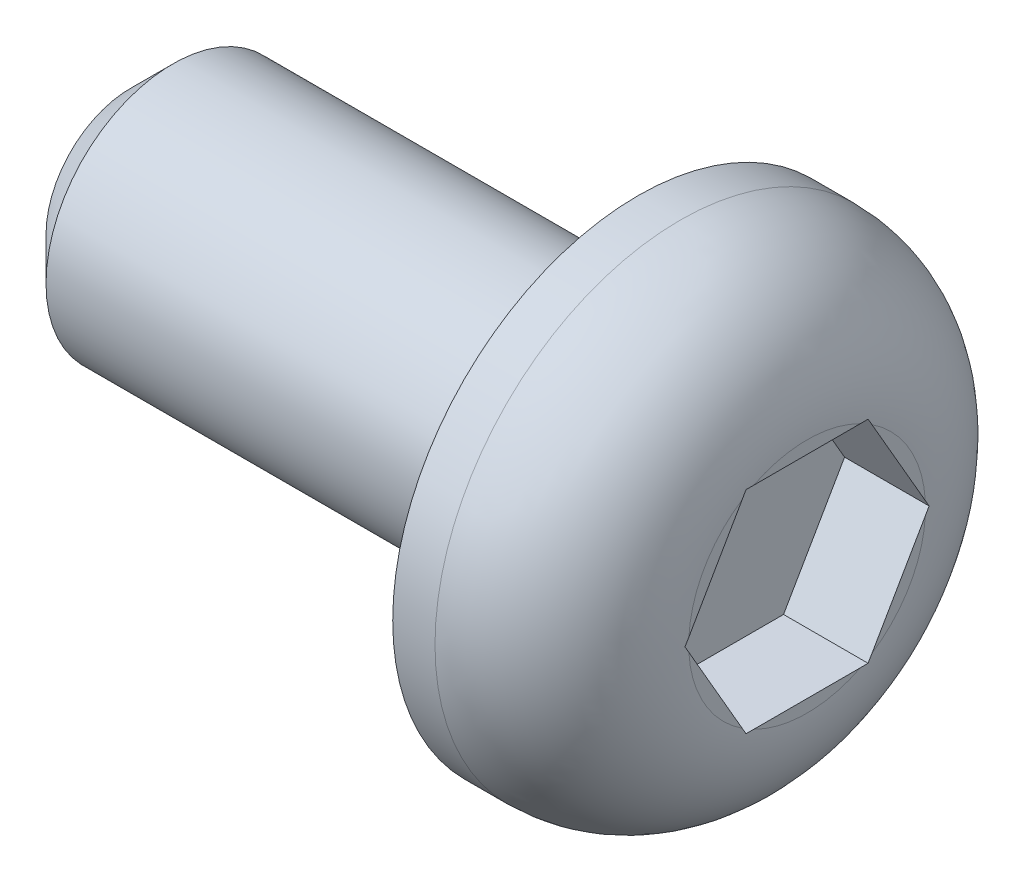
ISO-10303-21;
HEADER;
FILE_DESCRIPTION(('STEP AP214'),'2;1');
FILE_NAME('part.step','',(''),(''),'','','');
FILE_SCHEMA(('AUTOMOTIVE_DESIGN { 1 0 10303 214 1 1 1 1 }'));
ENDSEC;
DATA;
#1=APPLICATION_CONTEXT('core data for automotive mechanical design processes');
#2=APPLICATION_PROTOCOL_DEFINITION('international standard','automotive_design',2000,#1);
#3=PRODUCT_CONTEXT('',#1,'mechanical');
#4=PRODUCT('Part','Part','',(#3));
#5=PRODUCT_RELATED_PRODUCT_CATEGORY('part','',(#4));
#6=PRODUCT_DEFINITION_FORMATION('','',#4);
#7=PRODUCT_DEFINITION_CONTEXT('part definition',#1,'design');
#8=PRODUCT_DEFINITION('design','',#6,#7);
#9=PRODUCT_DEFINITION_SHAPE('','',#8);
#10=(LENGTH_UNIT() NAMED_UNIT(*) SI_UNIT(.MILLI.,.METRE.));
#11=(NAMED_UNIT(*) PLANE_ANGLE_UNIT() SI_UNIT($,.RADIAN.));
#12=(NAMED_UNIT(*) SI_UNIT($,.STERADIAN.) SOLID_ANGLE_UNIT());
#13=UNCERTAINTY_MEASURE_WITH_UNIT(LENGTH_MEASURE(1.E-05),#10,'distance_accuracy_value','');
#14=(GEOMETRIC_REPRESENTATION_CONTEXT(3) GLOBAL_UNCERTAINTY_ASSIGNED_CONTEXT((#13)) GLOBAL_UNIT_ASSIGNED_CONTEXT((#10,
#11,#12)) REPRESENTATION_CONTEXT('',''));
#15=CARTESIAN_POINT('',(0.,0.,0.));
#16=DIRECTION('',(0.,0.,1.));
#17=DIRECTION('',(1.,0.,0.));
#18=AXIS2_PLACEMENT_3D('',#15,#16,#17);
#19=CARTESIAN_POINT('',(2.,0.,0.));
#20=DIRECTION('',(1.,0.,0.));
#21=DIRECTION('',(0.,0.,-1.));
#22=AXIS2_PLACEMENT_3D('',#19,#20,#21);
#23=PLANE('',#22);
#24=DIRECTION('',(0.,-0.866025403784439,-0.5));
#25=VECTOR('',#24,1.);
#26=CARTESIAN_POINT('',(2.,0.,2.94337567297406));
#27=LINE('',#26,#25);
#28=CARTESIAN_POINT('',(2.,-0.0789917583039617,2.89776976005351));
#29=VERTEX_POINT('',#28);
#30=CARTESIAN_POINT('',(2.,-1.17100824169604,2.26729374940759));
#31=VERTEX_POINT('',#30);
#32=EDGE_CURVE('E164',#29,#31,#27,.T.);
#33=ORIENTED_EDGE('',*,*,#32,.F.);
#34=CARTESIAN_POINT('',(2.,0.,1.5));
#35=DIRECTION('',(1.,0.,0.));
#36=DIRECTION('',(0.,0.,-1.));
#37=AXIS2_PLACEMENT_3D('',#34,#35,#36);
#38=CIRCLE('',#37,1.4);
#39=EDGE_CURVE('E201',#29,#31,#38,.T.);
#40=ORIENTED_EDGE('',*,*,#39,.T.);
#41=EDGE_LOOP('',(#33,#40));
#42=FACE_BOUND('',#41,.T.);
#43=ADVANCED_FACE('F34',(#42),#23,.T.);
#44=DIRECTION('',(0.,0.,-1.));
#45=VECTOR('',#44,1.);
#46=CARTESIAN_POINT('',(2.,-1.25,2.22168783648703));
#47=LINE('',#46,#45);
#48=CARTESIAN_POINT('',(2.,-1.25,2.13047601064592));
#49=VERTEX_POINT('',#48);
#50=CARTESIAN_POINT('',(2.,-1.25,0.869523989354076));
#51=VERTEX_POINT('',#50);
#52=EDGE_CURVE('E166',#49,#51,#47,.T.);
#53=ORIENTED_EDGE('',*,*,#52,.F.);
#54=CARTESIAN_POINT('',(2.,0.,1.5));
#55=DIRECTION('',(1.,0.,0.));
#56=DIRECTION('',(0.,0.,-1.));
#57=AXIS2_PLACEMENT_3D('',#54,#55,#56);
#58=CIRCLE('',#57,1.4);
#59=EDGE_CURVE('E199',#49,#51,#58,.T.);
#60=ORIENTED_EDGE('',*,*,#59,.T.);
#61=EDGE_LOOP('',(#53,#60));
#62=FACE_BOUND('',#61,.T.);
#63=ADVANCED_FACE('F254',(#62),#23,.T.);
#64=DIRECTION('',(0.,0.866025403784439,-0.5));
#65=VECTOR('',#64,1.);
#66=CARTESIAN_POINT('',(2.,-1.25,0.778312163512968));
#67=LINE('',#66,#65);
#68=CARTESIAN_POINT('',(2.,-1.17100824169604,0.732706250592413));
#69=VERTEX_POINT('',#68);
#70=CARTESIAN_POINT('',(2.,-0.0789917583039618,0.102230239946489));
#71=VERTEX_POINT('',#70);
#72=EDGE_CURVE('E169',#69,#71,#67,.T.);
#73=ORIENTED_EDGE('',*,*,#72,.F.);
#74=CARTESIAN_POINT('',(2.,0.,1.5));
#75=DIRECTION('',(1.,0.,0.));
#76=DIRECTION('',(0.,0.,-1.));
#77=AXIS2_PLACEMENT_3D('',#74,#75,#76);
#78=CIRCLE('',#77,1.4);
#79=EDGE_CURVE('E197',#69,#71,#78,.T.);
#80=ORIENTED_EDGE('',*,*,#79,.T.);
#81=EDGE_LOOP('',(#73,#80));
#82=FACE_BOUND('',#81,.T.);
#83=ADVANCED_FACE('F259',(#82),#23,.T.);
#84=DIRECTION('',(0.,0.866025403784439,0.5));
#85=VECTOR('',#84,1.);
#86=CARTESIAN_POINT('',(2.,0.,0.0566243270259353));
#87=LINE('',#86,#85);
#88=CARTESIAN_POINT('',(2.,0.0789917583039615,0.10223023994649));
#89=VERTEX_POINT('',#88);
#90=CARTESIAN_POINT('',(2.,1.17100824169604,0.732706250592413));
#91=VERTEX_POINT('',#90);
#92=EDGE_CURVE('E172',#89,#91,#87,.T.);
#93=ORIENTED_EDGE('',*,*,#92,.F.);
#94=CARTESIAN_POINT('',(2.,0.,1.5));
#95=DIRECTION('',(1.,0.,0.));
#96=DIRECTION('',(0.,0.,-1.));
#97=AXIS2_PLACEMENT_3D('',#94,#95,#96);
#98=CIRCLE('',#97,1.4);
#99=EDGE_CURVE('E195',#89,#91,#98,.T.);
#100=ORIENTED_EDGE('',*,*,#99,.T.);
#101=EDGE_LOOP('',(#93,#100));
#102=FACE_BOUND('',#101,.T.);
#103=ADVANCED_FACE('F249',(#102),#23,.T.);
#104=DIRECTION('',(0.,0.,1.));
#105=VECTOR('',#104,1.);
#106=CARTESIAN_POINT('',(2.,1.25,0.778312163512968));
#107=LINE('',#106,#105);
#108=CARTESIAN_POINT('',(2.,1.25,0.869523989354076));
#109=VERTEX_POINT('',#108);
#110=CARTESIAN_POINT('',(2.,1.25,2.13047601064592));
#111=VERTEX_POINT('',#110);
#112=EDGE_CURVE('E154',#109,#111,#107,.T.);
#113=ORIENTED_EDGE('',*,*,#112,.F.);
#114=CARTESIAN_POINT('',(2.,0.,1.5));
#115=DIRECTION('',(1.,0.,0.));
#116=DIRECTION('',(0.,0.,-1.));
#117=AXIS2_PLACEMENT_3D('',#114,#115,#116);
#118=CIRCLE('',#117,1.4);
#119=EDGE_CURVE('E193',#109,#111,#118,.T.);
#120=ORIENTED_EDGE('',*,*,#119,.T.);
#121=EDGE_LOOP('',(#113,#120));
#122=FACE_BOUND('',#121,.T.);
#123=ADVANCED_FACE('F240',(#122),#23,.T.);
#124=CARTESIAN_POINT('',(0.,0.,1.5));
#125=DIRECTION('',(1.,0.,0.));
#126=DIRECTION('',(0.,0.,-1.));
#127=AXIS2_PLACEMENT_3D('',#124,#125,#126);
#128=CYLINDRICAL_SURFACE('',#127,1.5);
#129=CARTESIAN_POINT('',(-5.5,0.,1.5));
#130=DIRECTION('',(-1.,0.,0.));
#131=DIRECTION('',(0.,0.,1.));
#132=AXIS2_PLACEMENT_3D('',#129,#130,#131);
#133=CIRCLE('',#132,1.5);
#134=CARTESIAN_POINT('',(-5.5,0.,3.));
#135=VERTEX_POINT('',#134);
#136=EDGE_CURVE('E42',#135,#135,#133,.F.);
#137=ORIENTED_EDGE('',*,*,#136,.T.);
#138=EDGE_LOOP('',(#137));
#139=FACE_BOUND('',#138,.T.);
#140=CARTESIAN_POINT('',(0.,0.,1.5));
#141=DIRECTION('',(1.,0.,0.));
#142=DIRECTION('',(0.,0.,-1.));
#143=AXIS2_PLACEMENT_3D('',#140,#141,#142);
#144=CIRCLE('',#143,1.5);
#145=CARTESIAN_POINT('',(0.,0.,0.));
#146=VERTEX_POINT('',#145);
#147=EDGE_CURVE('E177',#146,#146,#144,.T.);
#148=ORIENTED_EDGE('',*,*,#147,.F.);
#149=EDGE_LOOP('',(#148));
#150=FACE_BOUND('',#149,.T.);
#151=ADVANCED_FACE('F242',(#139,#150),#128,.T.);
#152=CARTESIAN_POINT('',(-6.,0.,0.));
#153=DIRECTION('',(-1.,0.,0.));
#154=DIRECTION('',(0.,0.,1.));
#155=AXIS2_PLACEMENT_3D('',#152,#153,#154);
#156=PLANE('',#155);
#157=CARTESIAN_POINT('',(-6.,0.,1.5));
#158=DIRECTION('',(-1.,0.,0.));
#159=DIRECTION('',(0.,0.,1.));
#160=AXIS2_PLACEMENT_3D('',#157,#158,#159);
#161=CIRCLE('',#160,0.999999999999996);
#162=CARTESIAN_POINT('',(-6.,0.,2.5));
#163=VERTEX_POINT('',#162);
#164=EDGE_CURVE('E11',#163,#163,#161,.T.);
#165=ORIENTED_EDGE('',*,*,#164,.T.);
#166=EDGE_LOOP('',(#165));
#167=FACE_BOUND('',#166,.T.);
#168=ADVANCED_FACE('F238',(#167),#156,.T.);
#169=DIRECTION('',(0.,-0.866025403784439,0.5));
#170=VECTOR('',#169,1.);
#171=CARTESIAN_POINT('',(2.,1.25,2.22168783648703));
#172=LINE('',#171,#170);
#173=CARTESIAN_POINT('',(2.,1.17100824169604,2.26729374940759));
#174=VERTEX_POINT('',#173);
#175=CARTESIAN_POINT('',(2.,0.0789917583039618,2.89776976005351));
#176=VERTEX_POINT('',#175);
#177=EDGE_CURVE('E151',#174,#176,#172,.T.);
#178=ORIENTED_EDGE('',*,*,#177,.F.);
#179=CARTESIAN_POINT('',(2.,0.,1.5));
#180=DIRECTION('',(1.,0.,0.));
#181=DIRECTION('',(0.,0.,-1.));
#182=AXIS2_PLACEMENT_3D('',#179,#180,#181);
#183=CIRCLE('',#182,1.4);
#184=EDGE_CURVE('E191',#174,#176,#183,.T.);
#185=ORIENTED_EDGE('',*,*,#184,.T.);
#186=EDGE_LOOP('',(#178,#185));
#187=FACE_BOUND('',#186,.T.);
#188=ADVANCED_FACE('F234',(#187),#23,.T.);
#189=CARTESIAN_POINT('',(0.,0.,1.5));
#190=DIRECTION('',(1.,0.,0.));
#191=DIRECTION('',(0.,0.,-1.));
#192=AXIS2_PLACEMENT_3D('',#189,#190,#191);
#193=CYLINDRICAL_SURFACE('',#192,2.9);
#194=CARTESIAN_POINT('',(0.5,0.,1.5));
#195=DIRECTION('',(1.,0.,0.));
#196=DIRECTION('',(0.,0.,-1.));
#197=AXIS2_PLACEMENT_3D('',#194,#195,#196);
#198=CIRCLE('',#197,2.9);
#199=CARTESIAN_POINT('',(0.5,0.,-1.4));
#200=VERTEX_POINT('',#199);
#201=EDGE_CURVE('E481',#200,#200,#198,.F.);
#202=ORIENTED_EDGE('',*,*,#201,.T.);
#203=EDGE_LOOP('',(#202));
#204=FACE_BOUND('',#203,.T.);
#205=CARTESIAN_POINT('',(0.,0.,1.5));
#206=DIRECTION('',(1.,0.,0.));
#207=DIRECTION('',(0.,0.,-1.));
#208=AXIS2_PLACEMENT_3D('',#205,#206,#207);
#209=CIRCLE('',#208,2.9);
#210=CARTESIAN_POINT('',(0.,0.,-1.4));
#211=VERTEX_POINT('',#210);
#212=EDGE_CURVE('E188',#211,#211,#209,.T.);
#213=ORIENTED_EDGE('',*,*,#212,.T.);
#214=EDGE_LOOP('',(#213));
#215=FACE_BOUND('',#214,.T.);
#216=ADVANCED_FACE('F230',(#204,#215),#193,.T.);
#217=CARTESIAN_POINT('',(0.,0.,0.));
#218=DIRECTION('',(1.,0.,0.));
#219=DIRECTION('',(0.,0.,-1.));
#220=AXIS2_PLACEMENT_3D('',#217,#218,#219);
#221=PLANE('',#220);
#222=ORIENTED_EDGE('',*,*,#212,.F.);
#223=EDGE_LOOP('',(#222));
#224=FACE_BOUND('',#223,.T.);
#225=ORIENTED_EDGE('',*,*,#147,.T.);
#226=EDGE_LOOP('',(#225));
#227=FACE_BOUND('',#226,.T.);
#228=ADVANCED_FACE('F224',(#224,#227),#221,.F.);
#229=CARTESIAN_POINT('',(1.,0.,2.94337567297406));
#230=DIRECTION('',(0.,-0.5,0.866025403784439));
#231=DIRECTION('',(0.,-0.866025403784439,-0.5));
#232=AXIS2_PLACEMENT_3D('',#229,#230,#231);
#233=PLANE('',#232);
#234=ORIENTED_EDGE('',*,*,#32,.T.);
#235=CARTESIAN_POINT('',(2.,-1.17100824169604,2.26729374940759));
#236=CARTESIAN_POINT('',(2.00000539805275,-1.1841741811381,2.25969239072658));
#237=CARTESIAN_POINT('',(1.99995582374529,-1.19733979317484,2.25209122107312));
#238=CARTESIAN_POINT('',(1.99974673027623,-1.223670379277,2.23688925009912));
#239=CARTESIAN_POINT('',(1.999587210974,-1.23683535334158,2.22928844877906));
#240=CARTESIAN_POINT('',(1.99937271917094,-1.25,2.22168783648703));
#241=B_SPLINE_CURVE_WITH_KNOTS('',3,(#235,#236,#237,#238,#239,#240),.UNSPECIFIED.,.F.,.F.,(4,2,
4),(0.,0.0456072604102869,0.091214579155445),.UNSPECIFIED.);
#242=CARTESIAN_POINT('',(1.99937271917094,-1.25,2.22168783648703));
#243=VERTEX_POINT('',#242);
#244=EDGE_CURVE('E133',#31,#243,#241,.T.);
#245=ORIENTED_EDGE('',*,*,#244,.T.);
#246=DIRECTION('',(1.,0.,0.));
#247=VECTOR('',#246,1.);
#248=CARTESIAN_POINT('',(1.,-1.25,2.22168783648703));
#249=LINE('',#248,#247);
#250=CARTESIAN_POINT('',(1.,-1.25,2.22168783648703));
#251=VERTEX_POINT('',#250);
#252=EDGE_CURVE('E125',#251,#243,#249,.T.);
#253=ORIENTED_EDGE('',*,*,#252,.F.);
#254=DIRECTION('',(0.,-0.866025403784439,-0.5));
#255=VECTOR('',#254,1.);
#256=CARTESIAN_POINT('',(1.,0.,2.94337567297406));
#257=LINE('',#256,#255);
#258=CARTESIAN_POINT('',(1.,0.,2.94337567297406));
#259=VERTEX_POINT('',#258);
#260=EDGE_CURVE('E131',#259,#251,#257,.T.);
#261=ORIENTED_EDGE('',*,*,#260,.F.);
#262=DIRECTION('',(1.,0.,0.));
#263=VECTOR('',#262,1.);
#264=CARTESIAN_POINT('',(1.,0.,2.94337567297406));
#265=LINE('',#264,#263);
#266=CARTESIAN_POINT('',(1.99937271917094,0.,2.94337567297406));
#267=VERTEX_POINT('',#266);
#268=EDGE_CURVE('E175',#259,#267,#265,.T.);
#269=ORIENTED_EDGE('',*,*,#268,.T.);
#270=CARTESIAN_POINT('',(1.99937271917094,0.,2.94337567297406));
#271=CARTESIAN_POINT('',(1.999587210974,-0.0131646466584189,2.93577506068204));
#272=CARTESIAN_POINT('',(1.99974673027623,-0.0263296207229975,2.92817425936198));
#273=CARTESIAN_POINT('',(1.99995582374529,-0.0526602068251556,2.91297228838798));
#274=CARTESIAN_POINT('',(2.00000539805275,-0.0658258188618976,2.90537111873452));
#275=CARTESIAN_POINT('',(2.,-0.0789917583039617,2.89776976005351));
#276=B_SPLINE_CURVE_WITH_KNOTS('',3,(#270,#271,#272,#273,#274,#275),.UNSPECIFIED.,.F.,.F.,(4,2,
4),(0.,0.0456073187451573,0.0912145791554439),.UNSPECIFIED.);
#277=EDGE_CURVE('E204',#267,#29,#276,.T.);
#278=ORIENTED_EDGE('',*,*,#277,.T.);
#279=EDGE_LOOP('',(#234,#245,#253,#261,#269,#278));
#280=FACE_BOUND('',#279,.T.);
#281=ADVANCED_FACE('F128',(#280),#233,.F.);
#282=CARTESIAN_POINT('',(1.,1.25,2.22168783648703));
#283=DIRECTION('',(0.,0.5,0.866025403784439));
#284=DIRECTION('',(0.,-0.866025403784439,0.5));
#285=AXIS2_PLACEMENT_3D('',#282,#283,#284);
#286=PLANE('',#285);
#287=DIRECTION('',(1.,0.,0.));
#288=VECTOR('',#287,1.);
#289=CARTESIAN_POINT('',(1.,1.25,2.22168783648703));
#290=LINE('',#289,#288);
#291=CARTESIAN_POINT('',(1.,1.25,2.22168783648703));
#292=VERTEX_POINT('',#291);
#293=CARTESIAN_POINT('',(1.99937271917094,1.25,2.22168783648703));
#294=VERTEX_POINT('',#293);
#295=EDGE_CURVE('E178',#292,#294,#290,.T.);
#296=ORIENTED_EDGE('',*,*,#295,.T.);
#297=CARTESIAN_POINT('',(1.99937271917094,1.25,2.22168783648703));
#298=CARTESIAN_POINT('',(1.999587210974,1.23683535334158,2.22928844877906));
#299=CARTESIAN_POINT('',(1.99974673027623,1.223670379277,2.23688925009912));
#300=CARTESIAN_POINT('',(1.99995582374529,1.19733979317484,2.25209122107312));
#301=CARTESIAN_POINT('',(2.00000539805275,1.1841741811381,2.25969239072658));
#302=CARTESIAN_POINT('',(2.,1.17100824169604,2.26729374940759));
#303=B_SPLINE_CURVE_WITH_KNOTS('',3,(#297,#298,#299,#300,#301,#302),.UNSPECIFIED.,.F.,.F.,(4,2,
4),(0.,0.0456073187451579,0.0912145791554451),.UNSPECIFIED.);
#304=EDGE_CURVE('E334',#294,#174,#303,.T.);
#305=ORIENTED_EDGE('',*,*,#304,.T.);
#306=ORIENTED_EDGE('',*,*,#177,.T.);
#307=CARTESIAN_POINT('',(2.,0.0789917583039618,2.89776976005351));
#308=CARTESIAN_POINT('',(2.00000539805275,0.0658258188618976,2.90537111873452));
#309=CARTESIAN_POINT('',(1.99995582374529,0.0526602068251556,2.91297228838798));
#310=CARTESIAN_POINT('',(1.99974673027623,0.0263296207229974,2.92817425936198));
#311=CARTESIAN_POINT('',(1.999587210974,0.0131646466584188,2.93577506068204));
#312=CARTESIAN_POINT('',(1.99937271917094,0.,2.94337567297406));
#313=B_SPLINE_CURVE_WITH_KNOTS('',3,(#307,#308,#309,#310,#311,#312),.UNSPECIFIED.,.F.,.F.,(4,2,
4),(0.,0.0456072604102868,0.0912145791554441),.UNSPECIFIED.);
#314=EDGE_CURVE('E328',#176,#267,#313,.T.);
#315=ORIENTED_EDGE('',*,*,#314,.T.);
#316=ORIENTED_EDGE('',*,*,#268,.F.);
#317=DIRECTION('',(0.,-0.866025403784439,0.5));
#318=VECTOR('',#317,1.);
#319=CARTESIAN_POINT('',(1.,1.25,2.22168783648703));
#320=LINE('',#319,#318);
#321=EDGE_CURVE('E137',#292,#259,#320,.T.);
#322=ORIENTED_EDGE('',*,*,#321,.F.);
#323=EDGE_LOOP('',(#296,#305,#306,#315,#316,#322));
#324=FACE_BOUND('',#323,.T.);
#325=ADVANCED_FACE('F223',(#324),#286,.F.);
#326=CARTESIAN_POINT('',(1.,1.25,0.778312163512968));
#327=DIRECTION('',(0.,1.,0.));
#328=DIRECTION('',(0.,0.,1.));
#329=AXIS2_PLACEMENT_3D('',#326,#327,#328);
#330=PLANE('',#329);
#331=DIRECTION('',(1.,0.,0.));
#332=VECTOR('',#331,1.);
#333=CARTESIAN_POINT('',(1.,1.25,0.778312163512968));
#334=LINE('',#333,#332);
#335=CARTESIAN_POINT('',(1.,1.25,0.778312163512968));
#336=VERTEX_POINT('',#335);
#337=CARTESIAN_POINT('',(1.99937271917094,1.25,0.778312163512968));
#338=VERTEX_POINT('',#337);
#339=EDGE_CURVE('E180',#336,#338,#334,.T.);
#340=ORIENTED_EDGE('',*,*,#339,.T.);
#341=CARTESIAN_POINT('',(1.99937271917094,1.25,0.778312163512968));
#342=CARTESIAN_POINT('',(1.999587210974,1.25,0.793513388097017));
#343=CARTESIAN_POINT('',(1.99974673027623,1.25,0.808714990737135));
#344=CARTESIAN_POINT('',(1.99995582374529,1.25,0.839118932685138));
#345=CARTESIAN_POINT('',(2.00000539805275,1.25,0.854321271992056));
#346=CARTESIAN_POINT('',(2.,1.25,0.869523989354076));
#347=B_SPLINE_CURVE_WITH_KNOTS('',3,(#341,#342,#343,#344,#345,#346),.UNSPECIFIED.,.F.,.F.,(4,2,
4),(0.,0.0456073187451576,0.0912145791554443),.UNSPECIFIED.);
#348=EDGE_CURVE('E322',#338,#109,#347,.T.);
#349=ORIENTED_EDGE('',*,*,#348,.T.);
#350=ORIENTED_EDGE('',*,*,#112,.T.);
#351=CARTESIAN_POINT('',(2.,1.25,2.13047601064592));
#352=CARTESIAN_POINT('',(2.00000539805275,1.25,2.14567872800794));
#353=CARTESIAN_POINT('',(1.99995582374529,1.25,2.16088106731486));
#354=CARTESIAN_POINT('',(1.99974673027623,1.25,2.19128500926286));
#355=CARTESIAN_POINT('',(1.999587210974,1.25,2.20648661190298));
#356=CARTESIAN_POINT('',(1.99937271917094,1.25,2.22168783648703));
#357=B_SPLINE_CURVE_WITH_KNOTS('',3,(#351,#352,#353,#354,#355,#356),.UNSPECIFIED.,.F.,.F.,(4,2,
4),(0.,0.0456072604102869,0.0912145791554451),.UNSPECIFIED.);
#358=EDGE_CURVE('E49',#111,#294,#357,.T.);
#359=ORIENTED_EDGE('',*,*,#358,.T.);
#360=ORIENTED_EDGE('',*,*,#295,.F.);
#361=DIRECTION('',(0.,0.,1.));
#362=VECTOR('',#361,1.);
#363=CARTESIAN_POINT('',(1.,1.25,0.778312163512968));
#364=LINE('',#363,#362);
#365=EDGE_CURVE('E161',#336,#292,#364,.T.);
#366=ORIENTED_EDGE('',*,*,#365,.F.);
#367=EDGE_LOOP('',(#340,#349,#350,#359,#360,#366));
#368=FACE_BOUND('',#367,.T.);
#369=ADVANCED_FACE('F302',(#368),#330,.F.);
#370=CARTESIAN_POINT('',(1.,0.,0.0566243270259355));
#371=DIRECTION('',(0.,0.5,-0.866025403784439));
#372=DIRECTION('',(0.,0.866025403784439,0.5));
#373=AXIS2_PLACEMENT_3D('',#370,#371,#372);
#374=PLANE('',#373);
#375=DIRECTION('',(1.,0.,0.));
#376=VECTOR('',#375,1.);
#377=CARTESIAN_POINT('',(1.,0.,0.0566243270259355));
#378=LINE('',#377,#376);
#379=CARTESIAN_POINT('',(1.,0.,0.0566243270259355));
#380=VERTEX_POINT('',#379);
#381=CARTESIAN_POINT('',(1.99937271917094,0.,0.0566243270259353));
#382=VERTEX_POINT('',#381);
#383=EDGE_CURVE('E182',#380,#382,#378,.T.);
#384=ORIENTED_EDGE('',*,*,#383,.T.);
#385=CARTESIAN_POINT('',(1.99937271917094,0.,0.0566243270259353));
#386=CARTESIAN_POINT('',(1.999587210974,0.013164646658419,0.0642249393179598));
#387=CARTESIAN_POINT('',(1.99974673027623,0.0263296207229976,0.0718257406380187));
#388=CARTESIAN_POINT('',(1.99995582374529,0.0526602068251556,0.0870277116120203));
#389=CARTESIAN_POINT('',(2.00000539805275,0.0658258188618976,0.0946288812654794));
#390=CARTESIAN_POINT('',(2.,0.0789917583039616,0.102230239946489));
#391=B_SPLINE_CURVE_WITH_KNOTS('',3,(#385,#386,#387,#388,#389,#390),.UNSPECIFIED.,.F.,.F.,(4,2,
4),(0.,0.0456073187451573,0.0912145791554439),.UNSPECIFIED.);
#392=EDGE_CURVE('E311',#382,#89,#391,.T.);
#393=ORIENTED_EDGE('',*,*,#392,.T.);
#394=ORIENTED_EDGE('',*,*,#92,.T.);
#395=CARTESIAN_POINT('',(2.,1.17100824169604,0.732706250592413));
#396=CARTESIAN_POINT('',(2.00000539805275,1.1841741811381,0.740307609273423));
#397=CARTESIAN_POINT('',(1.99995582374529,1.19733979317484,0.747908778926882));
#398=CARTESIAN_POINT('',(1.99974673027623,1.223670379277,0.763110749900884));
#399=CARTESIAN_POINT('',(1.999587210974,1.23683535334158,0.770711551220943));
#400=CARTESIAN_POINT('',(1.99937271917094,1.25,0.778312163512968));
#401=B_SPLINE_CURVE_WITH_KNOTS('',3,(#395,#396,#397,#398,#399,#400),.UNSPECIFIED.,.F.,.F.,(4,2,
4),(0.,0.0456072604102868,0.0912145791554442),.UNSPECIFIED.);
#402=EDGE_CURVE('E57',#91,#338,#401,.T.);
#403=ORIENTED_EDGE('',*,*,#402,.T.);
#404=ORIENTED_EDGE('',*,*,#339,.F.);
#405=DIRECTION('',(0.,0.866025403784439,0.5));
#406=VECTOR('',#405,1.);
#407=CARTESIAN_POINT('',(1.,0.,0.0566243270259355));
#408=LINE('',#407,#406);
#409=EDGE_CURVE('E158',#380,#336,#408,.T.);
#410=ORIENTED_EDGE('',*,*,#409,.F.);
#411=EDGE_LOOP('',(#384,#393,#394,#403,#404,#410));
#412=FACE_BOUND('',#411,.T.);
#413=ADVANCED_FACE('F296',(#412),#374,.F.);
#414=CARTESIAN_POINT('',(1.,-1.25,0.778312163512968));
#415=DIRECTION('',(0.,-0.5,-0.866025403784439));
#416=DIRECTION('',(0.,0.866025403784439,-0.5));
#417=AXIS2_PLACEMENT_3D('',#414,#415,#416);
#418=PLANE('',#417);
#419=DIRECTION('',(1.,0.,0.));
#420=VECTOR('',#419,1.);
#421=CARTESIAN_POINT('',(1.,-1.25,0.778312163512968));
#422=LINE('',#421,#420);
#423=CARTESIAN_POINT('',(1.,-1.25,0.778312163512968));
#424=VERTEX_POINT('',#423);
#425=CARTESIAN_POINT('',(1.99937271917094,-1.25,0.778312163512968));
#426=VERTEX_POINT('',#425);
#427=EDGE_CURVE('E136',#424,#426,#422,.T.);
#428=ORIENTED_EDGE('',*,*,#427,.T.);
#429=CARTESIAN_POINT('',(1.99937271917094,-1.25,0.778312163512968));
#430=CARTESIAN_POINT('',(1.999587210974,-1.23683535334158,0.770711551220943));
#431=CARTESIAN_POINT('',(1.99974673027623,-1.223670379277,0.763110749900884));
#432=CARTESIAN_POINT('',(1.99995582374529,-1.19733979317484,0.747908778926882));
#433=CARTESIAN_POINT('',(2.00000539805275,-1.1841741811381,0.740307609273423));
#434=CARTESIAN_POINT('',(2.,-1.17100824169604,0.732706250592413));
#435=B_SPLINE_CURVE_WITH_KNOTS('',3,(#429,#430,#431,#432,#433,#434),.UNSPECIFIED.,.F.,.F.,(4,2,
4),(0.,0.0456073187451574,0.0912145791554443),.UNSPECIFIED.);
#436=EDGE_CURVE('E286',#426,#69,#435,.T.);
#437=ORIENTED_EDGE('',*,*,#436,.T.);
#438=ORIENTED_EDGE('',*,*,#72,.T.);
#439=CARTESIAN_POINT('',(2.,-0.0789917583039615,0.10223023994649));
#440=CARTESIAN_POINT('',(2.00000539805275,-0.0658258188618976,0.0946288812654795));
#441=CARTESIAN_POINT('',(1.99995582374529,-0.0526602068251556,0.0870277116120203));
#442=CARTESIAN_POINT('',(1.99974673027623,-0.0263296207229976,0.0718257406380187));
#443=CARTESIAN_POINT('',(1.999587210974,-0.013164646658419,0.0642249393179598));
#444=CARTESIAN_POINT('',(1.99937271917094,0.,0.0566243270259353));
#445=B_SPLINE_CURVE_WITH_KNOTS('',3,(#439,#440,#441,#442,#443,#444),.UNSPECIFIED.,.F.,.F.,(4,2,
4),(0.,0.0456072604102866,0.0912145791554439),.UNSPECIFIED.);
#446=EDGE_CURVE('E270',#71,#382,#445,.T.);
#447=ORIENTED_EDGE('',*,*,#446,.T.);
#448=ORIENTED_EDGE('',*,*,#383,.F.);
#449=DIRECTION('',(0.,0.866025403784439,-0.5));
#450=VECTOR('',#449,1.);
#451=CARTESIAN_POINT('',(1.,-1.25,0.778312163512968));
#452=LINE('',#451,#450);
#453=EDGE_CURVE('E146',#424,#380,#452,.T.);
#454=ORIENTED_EDGE('',*,*,#453,.F.);
#455=EDGE_LOOP('',(#428,#437,#438,#447,#448,#454));
#456=FACE_BOUND('',#455,.T.);
#457=ADVANCED_FACE('F292',(#456),#418,.F.);
#458=CARTESIAN_POINT('',(1.,-1.25,2.22168783648703));
#459=DIRECTION('',(0.,-1.,0.));
#460=DIRECTION('',(0.,0.,-1.));
#461=AXIS2_PLACEMENT_3D('',#458,#459,#460);
#462=PLANE('',#461);
#463=ORIENTED_EDGE('',*,*,#252,.T.);
#464=CARTESIAN_POINT('',(1.99937271917094,-1.25,2.22168783648703));
#465=CARTESIAN_POINT('',(1.999587210974,-1.25,2.20648661190298));
#466=CARTESIAN_POINT('',(1.99974673027623,-1.25,2.19128500926287));
#467=CARTESIAN_POINT('',(1.99995582374529,-1.25,2.16088106731486));
#468=CARTESIAN_POINT('',(2.00000539805275,-1.25,2.14567872800794));
#469=CARTESIAN_POINT('',(2.,-1.25,2.13047601064592));
#470=B_SPLINE_CURVE_WITH_KNOTS('',3,(#464,#465,#466,#467,#468,#469),.UNSPECIFIED.,.F.,.F.,(4,2,
4),(0.,0.0456073187451577,0.0912145791554446),.UNSPECIFIED.);
#471=EDGE_CURVE('E267',#243,#49,#470,.T.);
#472=ORIENTED_EDGE('',*,*,#471,.T.);
#473=ORIENTED_EDGE('',*,*,#52,.T.);
#474=CARTESIAN_POINT('',(2.,-1.25,0.869523989354076));
#475=CARTESIAN_POINT('',(2.00000539805275,-1.25,0.854321271992056));
#476=CARTESIAN_POINT('',(1.99995582374529,-1.25,0.839118932685138));
#477=CARTESIAN_POINT('',(1.99974673027623,-1.25,0.808714990737135));
#478=CARTESIAN_POINT('',(1.999587210974,-1.25,0.793513388097017));
#479=CARTESIAN_POINT('',(1.99937271917094,-1.25,0.778312163512968));
#480=B_SPLINE_CURVE_WITH_KNOTS('',3,(#474,#475,#476,#477,#478,#479),.UNSPECIFIED.,.F.,.F.,(4,2,
4),(0.,0.0456072604102868,0.0912145791554444),.UNSPECIFIED.);
#481=EDGE_CURVE('E268',#51,#426,#480,.T.);
#482=ORIENTED_EDGE('',*,*,#481,.T.);
#483=ORIENTED_EDGE('',*,*,#427,.F.);
#484=DIRECTION('',(0.,0.,-1.));
#485=VECTOR('',#484,1.);
#486=CARTESIAN_POINT('',(1.,-1.25,2.22168783648703));
#487=LINE('',#486,#485);
#488=EDGE_CURVE('E140',#251,#424,#487,.T.);
#489=ORIENTED_EDGE('',*,*,#488,.F.);
#490=EDGE_LOOP('',(#463,#472,#473,#482,#483,#489));
#491=FACE_BOUND('',#490,.T.);
#492=ADVANCED_FACE('F141',(#491),#462,.F.);
#493=CARTESIAN_POINT('',(1.,0.,0.));
#494=DIRECTION('',(1.,0.,0.));
#495=DIRECTION('',(0.,0.,-1.));
#496=AXIS2_PLACEMENT_3D('',#493,#494,#495);
#497=PLANE('',#496);
#498=ORIENTED_EDGE('',*,*,#260,.T.);
#499=ORIENTED_EDGE('',*,*,#488,.T.);
#500=ORIENTED_EDGE('',*,*,#453,.T.);
#501=ORIENTED_EDGE('',*,*,#409,.T.);
#502=ORIENTED_EDGE('',*,*,#365,.T.);
#503=ORIENTED_EDGE('',*,*,#321,.T.);
#504=EDGE_LOOP('',(#498,#499,#500,#501,#502,#503));
#505=FACE_BOUND('',#504,.T.);
#506=ADVANCED_FACE('F148',(#505),#497,.T.);
#507=CARTESIAN_POINT('',(0.5,0.,1.5));
#508=DIRECTION('',(1.,0.,0.));
#509=DIRECTION('',(0.,0.,-1.));
#510=AXIS2_PLACEMENT_3D('',#507,#508,#509);
#511=DEGENERATE_TOROIDAL_SURFACE('',#510,1.4,1.5,.T.);
#512=ORIENTED_EDGE('',*,*,#201,.F.);
#513=EDGE_LOOP('',(#512));
#514=FACE_BOUND('',#513,.T.);
#515=ORIENTED_EDGE('',*,*,#244,.F.);
#516=ORIENTED_EDGE('',*,*,#39,.F.);
#517=ORIENTED_EDGE('',*,*,#277,.F.);
#518=ORIENTED_EDGE('',*,*,#314,.F.);
#519=ORIENTED_EDGE('',*,*,#184,.F.);
#520=ORIENTED_EDGE('',*,*,#304,.F.);
#521=ORIENTED_EDGE('',*,*,#358,.F.);
#522=ORIENTED_EDGE('',*,*,#119,.F.);
#523=ORIENTED_EDGE('',*,*,#348,.F.);
#524=ORIENTED_EDGE('',*,*,#402,.F.);
#525=ORIENTED_EDGE('',*,*,#99,.F.);
#526=ORIENTED_EDGE('',*,*,#392,.F.);
#527=ORIENTED_EDGE('',*,*,#446,.F.);
#528=ORIENTED_EDGE('',*,*,#79,.F.);
#529=ORIENTED_EDGE('',*,*,#436,.F.);
#530=ORIENTED_EDGE('',*,*,#481,.F.);
#531=ORIENTED_EDGE('',*,*,#59,.F.);
#532=ORIENTED_EDGE('',*,*,#471,.F.);
#533=EDGE_LOOP('',(#515,#516,#517,#518,#519,#520,#521,#522,#523,#524,#525,#526,#527,#528,#529,
#530,#531,#532));
#534=FACE_BOUND('',#533,.T.);
#535=ADVANCED_FACE('F216',(#514,#534),#511,.T.);
#536=CARTESIAN_POINT('',(-5.5,0.,1.5));
#537=DIRECTION('',(1.,0.,0.));
#538=DIRECTION('',(0.,0.,-1.));
#539=AXIS2_PLACEMENT_3D('',#536,#537,#538);
#540=CONICAL_SURFACE('',#539,1.5,0.78539816339745);
#541=ORIENTED_EDGE('',*,*,#164,.F.);
#542=EDGE_LOOP('',(#541));
#543=FACE_BOUND('',#542,.T.);
#544=ORIENTED_EDGE('',*,*,#136,.F.);
#545=EDGE_LOOP('',(#544));
#546=FACE_BOUND('',#545,.T.);
#547=ADVANCED_FACE('F36',(#543,#546),#540,.T.);
#548=CLOSED_SHELL('',(#43,#63,#83,#103,#123,#151,#168,#188,#216,#228,#281,#325,#369,#413,#457,
#492,#506,#535,#547));
#549=MANIFOLD_SOLID_BREP('B2',#548);
#550=ADVANCED_BREP_SHAPE_REPRESENTATION('',(#18,#549),#14);
#551=SHAPE_DEFINITION_REPRESENTATION(#9,#550);
ENDSEC;
END-ISO-10303-21;
